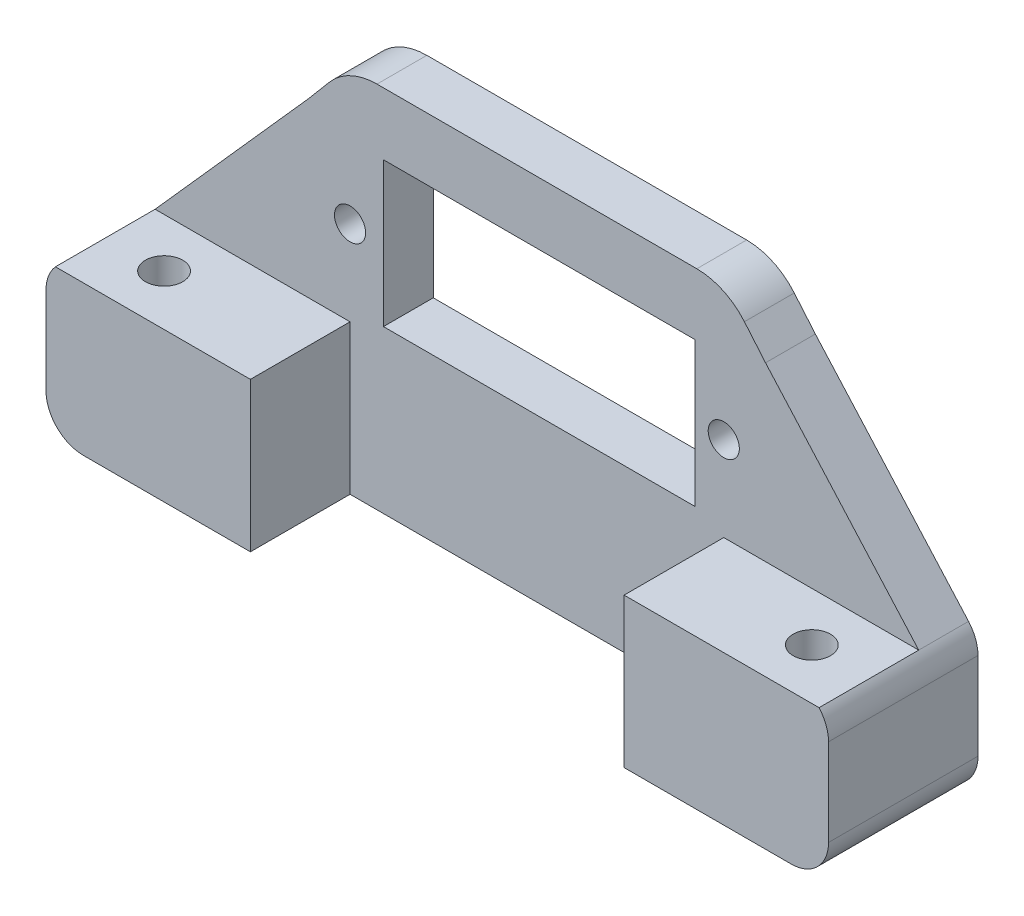
ISO-10303-21;
HEADER;
FILE_DESCRIPTION(('STEP AP214'),'2;1');
FILE_NAME('part.step','',(''),(''),'','','');
FILE_SCHEMA(('AUTOMOTIVE_DESIGN { 1 0 10303 214 1 1 1 1 }'));
ENDSEC;
DATA;
#1=APPLICATION_CONTEXT('core data for automotive mechanical design processes');
#2=APPLICATION_PROTOCOL_DEFINITION('international standard','automotive_design',2000,#1);
#3=PRODUCT_CONTEXT('',#1,'mechanical');
#4=PRODUCT('Part','Part','',(#3));
#5=PRODUCT_RELATED_PRODUCT_CATEGORY('part','',(#4));
#6=PRODUCT_DEFINITION_FORMATION('','',#4);
#7=PRODUCT_DEFINITION_CONTEXT('part definition',#1,'design');
#8=PRODUCT_DEFINITION('design','',#6,#7);
#9=PRODUCT_DEFINITION_SHAPE('','',#8);
#10=(LENGTH_UNIT() NAMED_UNIT(*) SI_UNIT(.MILLI.,.METRE.));
#11=(NAMED_UNIT(*) PLANE_ANGLE_UNIT() SI_UNIT($,.RADIAN.));
#12=(NAMED_UNIT(*) SI_UNIT($,.STERADIAN.) SOLID_ANGLE_UNIT());
#13=UNCERTAINTY_MEASURE_WITH_UNIT(LENGTH_MEASURE(1.E-05),#10,'distance_accuracy_value','');
#14=(GEOMETRIC_REPRESENTATION_CONTEXT(3) GLOBAL_UNCERTAINTY_ASSIGNED_CONTEXT((#13)) GLOBAL_UNIT_ASSIGNED_CONTEXT((#10,
#11,#12)) REPRESENTATION_CONTEXT('',''));
#15=CARTESIAN_POINT('',(0.,0.,0.));
#16=DIRECTION('',(0.,0.,1.));
#17=DIRECTION('',(1.,0.,0.));
#18=AXIS2_PLACEMENT_3D('',#15,#16,#17);
#19=CARTESIAN_POINT('',(41.4286280186862,-5.,4.));
#20=DIRECTION('',(0.,0.,-1.));
#21=DIRECTION('',(-1.,0.,0.));
#22=AXIS2_PLACEMENT_3D('',#19,#20,#21);
#23=CYLINDRICAL_SURFACE('',#22,5.);
#24=CARTESIAN_POINT('',(41.4286280186862,-5.,0.));
#25=DIRECTION('',(0.,0.,1.));
#26=DIRECTION('',(1.,0.,0.));
#27=AXIS2_PLACEMENT_3D('',#24,#25,#26);
#28=CIRCLE('',#27,5.);
#29=CARTESIAN_POINT('',(45.2485864933868,-1.77386961646575,0.));
#30=VERTEX_POINT('',#29);
#31=CARTESIAN_POINT('',(41.4286280186862,0.,0.));
#32=VERTEX_POINT('',#31);
#33=EDGE_CURVE('E221',#30,#32,#28,.T.);
#34=ORIENTED_EDGE('',*,*,#33,.T.);
#35=DIRECTION('',(0.,0.,-1.));
#36=VECTOR('',#35,1.);
#37=CARTESIAN_POINT('',(41.4286280186862,0.,4.));
#38=LINE('',#37,#36);
#39=CARTESIAN_POINT('',(41.4286280186862,0.,4.));
#40=VERTEX_POINT('',#39);
#41=EDGE_CURVE('E11',#40,#32,#38,.T.);
#42=ORIENTED_EDGE('',*,*,#41,.F.);
#43=CARTESIAN_POINT('',(41.4286280186862,-5.,4.));
#44=DIRECTION('',(0.,0.,1.));
#45=DIRECTION('',(1.,0.,0.));
#46=AXIS2_PLACEMENT_3D('',#43,#44,#45);
#47=CIRCLE('',#46,5.);
#48=CARTESIAN_POINT('',(45.2485864933868,-1.77386961646575,4.));
#49=VERTEX_POINT('',#48);
#50=EDGE_CURVE('E411',#49,#40,#47,.T.);
#51=ORIENTED_EDGE('',*,*,#50,.F.);
#52=DIRECTION('',(0.,0.,-1.));
#53=VECTOR('',#52,1.);
#54=CARTESIAN_POINT('',(45.2485864933868,-1.77386961646575,4.));
#55=LINE('',#54,#53);
#56=EDGE_CURVE('E255',#49,#30,#55,.T.);
#57=ORIENTED_EDGE('',*,*,#56,.T.);
#58=EDGE_LOOP('',(#34,#42,#51,#57));
#59=FACE_BOUND('',#58,.T.);
#60=ADVANCED_FACE('F41',(#59),#23,.T.);
#61=CARTESIAN_POINT('',(0.,0.,4.));
#62=DIRECTION('',(0.,1.,0.));
#63=DIRECTION('',(-1.,0.,0.));
#64=AXIS2_PLACEMENT_3D('',#61,#62,#63);
#65=PLANE('',#64);
#66=DIRECTION('',(1.,0.,0.));
#67=VECTOR('',#66,1.);
#68=CARTESIAN_POINT('',(0.,0.,0.));
#69=LINE('',#68,#67);
#70=CARTESIAN_POINT('',(15.7541159439414,0.,0.));
#71=VERTEX_POINT('',#70);
#72=EDGE_CURVE('E225',#71,#32,#69,.T.);
#73=ORIENTED_EDGE('',*,*,#72,.F.);
#74=DIRECTION('',(0.,0.,-1.));
#75=VECTOR('',#74,1.);
#76=CARTESIAN_POINT('',(15.7541159439414,0.,4.));
#77=LINE('',#76,#75);
#78=CARTESIAN_POINT('',(15.7541159439414,0.,4.));
#79=VERTEX_POINT('',#78);
#80=EDGE_CURVE('E52',#79,#71,#77,.T.);
#81=ORIENTED_EDGE('',*,*,#80,.F.);
#82=DIRECTION('',(1.,0.,0.));
#83=VECTOR('',#82,1.);
#84=CARTESIAN_POINT('',(0.,0.,4.));
#85=LINE('',#84,#83);
#86=EDGE_CURVE('E414',#79,#40,#85,.T.);
#87=ORIENTED_EDGE('',*,*,#86,.T.);
#88=ORIENTED_EDGE('',*,*,#41,.T.);
#89=EDGE_LOOP('',(#73,#81,#87,#88));
#90=FACE_BOUND('',#89,.T.);
#91=ADVANCED_FACE('F308',(#90),#65,.T.);
#92=CARTESIAN_POINT('',(15.7541159439414,-5.00000000000001,4.));
#93=DIRECTION('',(0.,0.,-1.));
#94=DIRECTION('',(-1.,0.,0.));
#95=AXIS2_PLACEMENT_3D('',#92,#93,#94);
#96=CYLINDRICAL_SURFACE('',#95,5.);
#97=CARTESIAN_POINT('',(15.7541159439414,-5.00000000000001,0.));
#98=DIRECTION('',(0.,0.,1.));
#99=DIRECTION('',(1.,0.,0.));
#100=AXIS2_PLACEMENT_3D('',#97,#98,#99);
#101=CIRCLE('',#100,5.);
#102=CARTESIAN_POINT('',(11.9341574692408,-1.77386961646574,0.));
#103=VERTEX_POINT('',#102);
#104=EDGE_CURVE('E229',#103,#71,#101,.F.);
#105=ORIENTED_EDGE('',*,*,#104,.F.);
#106=DIRECTION('',(0.,0.,-1.));
#107=VECTOR('',#106,1.);
#108=CARTESIAN_POINT('',(11.9341574692408,-1.77386961646574,4.));
#109=LINE('',#108,#107);
#110=CARTESIAN_POINT('',(11.9341574692408,-1.77386961646574,4.));
#111=VERTEX_POINT('',#110);
#112=EDGE_CURVE('E148',#111,#103,#109,.T.);
#113=ORIENTED_EDGE('',*,*,#112,.F.);
#114=CARTESIAN_POINT('',(15.7541159439414,-5.00000000000001,4.));
#115=DIRECTION('',(0.,0.,1.));
#116=DIRECTION('',(1.,0.,0.));
#117=AXIS2_PLACEMENT_3D('',#114,#115,#116);
#118=CIRCLE('',#117,5.);
#119=EDGE_CURVE('E160',#111,#79,#118,.F.);
#120=ORIENTED_EDGE('',*,*,#119,.T.);
#121=ORIENTED_EDGE('',*,*,#80,.T.);
#122=EDGE_LOOP('',(#105,#113,#120,#121));
#123=FACE_BOUND('',#122,.T.);
#124=ADVANCED_FACE('F314',(#123),#96,.T.);
#125=CARTESIAN_POINT('',(7.84019288441212,-6.62140299290913,4.));
#126=DIRECTION('',(-0.763991694940121,0.645226076706855,0.));
#127=DIRECTION('',(-0.645226076706855,-0.763991694940121,0.));
#128=AXIS2_PLACEMENT_3D('',#125,#126,#127);
#129=PLANE('',#128);
#130=DIRECTION('',(0.645226076706855,0.763991694940121,0.));
#131=VECTOR('',#130,1.);
#132=CARTESIAN_POINT('',(7.84019288441212,-6.62140299290913,0.));
#133=LINE('',#132,#131);
#134=CARTESIAN_POINT('',(10.2388227627629,-3.7812615720164,0.));
#135=VERTEX_POINT('',#134);
#136=EDGE_CURVE('E142',#135,#103,#133,.T.);
#137=ORIENTED_EDGE('',*,*,#136,.F.);
#138=DIRECTION('',(0.,0.,-1.));
#139=VECTOR('',#138,1.);
#140=CARTESIAN_POINT('',(10.2388227627629,-3.7812615720164,4.));
#141=LINE('',#140,#139);
#142=CARTESIAN_POINT('',(10.2388227627629,-3.7812615720164,4.));
#143=VERTEX_POINT('',#142);
#144=EDGE_CURVE('E137',#143,#135,#141,.T.);
#145=ORIENTED_EDGE('',*,*,#144,.F.);
#146=DIRECTION('',(0.645226076706855,0.763991694940121,0.));
#147=VECTOR('',#146,1.);
#148=CARTESIAN_POINT('',(7.84019288441212,-6.62140299290913,4.));
#149=LINE('',#148,#147);
#150=EDGE_CURVE('E140',#143,#111,#149,.T.);
#151=ORIENTED_EDGE('',*,*,#150,.T.);
#152=ORIENTED_EDGE('',*,*,#112,.T.);
#153=EDGE_LOOP('',(#137,#145,#151,#152));
#154=FACE_BOUND('',#153,.T.);
#155=ADVANCED_FACE('F139',(#154),#129,.T.);
#156=CARTESIAN_POINT('',(7.59390652992024,-6.75475778071939,4.));
#157=DIRECTION('',(-0.747183622636559,0.664617660060059,0.));
#158=DIRECTION('',(-0.664617660060059,-0.747183622636559,0.));
#159=AXIS2_PLACEMENT_3D('',#156,#157,#158);
#160=PLANE('',#159);
#161=DIRECTION('',(0.664617660060059,0.747183622636559,0.));
#162=VECTOR('',#161,1.);
#163=CARTESIAN_POINT('',(7.59390652992024,-6.75475778071939,0.));
#164=LINE('',#163,#162);
#165=CARTESIAN_POINT('',(-2.05913137357726,-17.607,0.));
#166=VERTEX_POINT('',#165);
#167=EDGE_CURVE('E235',#166,#135,#164,.T.);
#168=ORIENTED_EDGE('',*,*,#167,.F.);
#169=DIRECTION('',(0.,0.,-1.));
#170=VECTOR('',#169,1.);
#171=CARTESIAN_POINT('',(-2.05913137357726,-17.607,4.));
#172=LINE('',#171,#170);
#173=CARTESIAN_POINT('',(-2.05913137357726,-17.607,4.));
#174=VERTEX_POINT('',#173);
#175=EDGE_CURVE('E149',#174,#166,#172,.T.);
#176=ORIENTED_EDGE('',*,*,#175,.F.);
#177=DIRECTION('',(0.664617660060059,0.747183622636559,0.));
#178=VECTOR('',#177,1.);
#179=CARTESIAN_POINT('',(7.59390652992024,-6.75475778071939,4.));
#180=LINE('',#179,#178);
#181=EDGE_CURVE('E157',#174,#143,#180,.T.);
#182=ORIENTED_EDGE('',*,*,#181,.T.);
#183=ORIENTED_EDGE('',*,*,#144,.T.);
#184=EDGE_LOOP('',(#168,#176,#182,#183));
#185=FACE_BOUND('',#184,.T.);
#186=ADVANCED_FACE('F164',(#185),#160,.T.);
#187=CARTESIAN_POINT('',(0.,-29.6,4.));
#188=DIRECTION('',(0.,1.,0.));
#189=DIRECTION('',(0.,0.,1.));
#190=AXIS2_PLACEMENT_3D('',#187,#188,#189);
#191=PLANE('',#190);
#192=CARTESIAN_POINT('',(2.5913719813138,-29.6,7.92925546534134));
#193=DIRECTION('',(0.,1.,0.));
#194=DIRECTION('',(0.,0.,1.));
#195=AXIS2_PLACEMENT_3D('',#192,#193,#194);
#196=CIRCLE('',#195,1.5);
#197=CARTESIAN_POINT('',(2.5913719813138,-29.6,9.42925546534134));
#198=VERTEX_POINT('',#197);
#199=EDGE_CURVE('E686',#198,#198,#196,.T.);
#200=ORIENTED_EDGE('',*,*,#199,.T.);
#201=EDGE_LOOP('',(#200));
#202=FACE_BOUND('',#201,.T.);
#203=CARTESIAN_POINT('',(54.5913719813138,-29.6,7.92925546534134));
#204=DIRECTION('',(0.,1.,0.));
#205=DIRECTION('',(0.,0.,-1.));
#206=AXIS2_PLACEMENT_3D('',#203,#204,#205);
#207=CIRCLE('',#206,1.5);
#208=CARTESIAN_POINT('',(54.5913719813138,-29.6,6.42925546534133));
#209=VERTEX_POINT('',#208);
#210=EDGE_CURVE('E690',#209,#209,#207,.T.);
#211=ORIENTED_EDGE('',*,*,#210,.T.);
#212=EDGE_LOOP('',(#211));
#213=FACE_BOUND('',#212,.T.);
#214=DIRECTION('',(1.,0.,0.));
#215=VECTOR('',#214,1.);
#216=CARTESIAN_POINT('',(0.,-29.6,0.));
#217=LINE('',#216,#215);
#218=CARTESIAN_POINT('',(0.182743962627623,-29.6,0.));
#219=VERTEX_POINT('',#218);
#220=CARTESIAN_POINT('',(57.,-29.6,0.));
#221=VERTEX_POINT('',#220);
#222=EDGE_CURVE('E238',#219,#221,#217,.T.);
#223=ORIENTED_EDGE('',*,*,#222,.T.);
#224=DIRECTION('',(0.,0.,-1.));
#225=VECTOR('',#224,1.);
#226=CARTESIAN_POINT('',(57.,-29.6,12.));
#227=LINE('',#226,#225);
#228=CARTESIAN_POINT('',(57.,-29.6,12.));
#229=VERTEX_POINT('',#228);
#230=EDGE_CURVE('E358',#229,#221,#227,.T.);
#231=ORIENTED_EDGE('',*,*,#230,.F.);
#232=DIRECTION('',(1.,0.,0.));
#233=VECTOR('',#232,1.);
#234=CARTESIAN_POINT('',(0.,-29.6,12.));
#235=LINE('',#234,#233);
#236=CARTESIAN_POINT('',(43.5913719813138,-29.6,12.));
#237=VERTEX_POINT('',#236);
#238=EDGE_CURVE('E482',#237,#229,#235,.T.);
#239=ORIENTED_EDGE('',*,*,#238,.F.);
#240=DIRECTION('',(0.,0.,-1.));
#241=VECTOR('',#240,1.);
#242=CARTESIAN_POINT('',(43.5913719813138,-29.6,12.));
#243=LINE('',#242,#241);
#244=CARTESIAN_POINT('',(43.5913719813138,-29.6,4.));
#245=VERTEX_POINT('',#244);
#246=EDGE_CURVE('E479',#237,#245,#243,.T.);
#247=ORIENTED_EDGE('',*,*,#246,.T.);
#248=DIRECTION('',(1.,0.,0.));
#249=VECTOR('',#248,1.);
#250=CARTESIAN_POINT('',(0.,-29.6,4.));
#251=LINE('',#250,#249);
#252=CARTESIAN_POINT('',(13.5913719813138,-29.6,4.));
#253=VERTEX_POINT('',#252);
#254=EDGE_CURVE('E178',#253,#245,#251,.T.);
#255=ORIENTED_EDGE('',*,*,#254,.F.);
#256=DIRECTION('',(0.,0.,-1.));
#257=VECTOR('',#256,1.);
#258=CARTESIAN_POINT('',(13.5913719813138,-29.6,12.));
#259=LINE('',#258,#257);
#260=CARTESIAN_POINT('',(13.5913719813138,-29.6,12.));
#261=VERTEX_POINT('',#260);
#262=EDGE_CURVE('E380',#261,#253,#259,.T.);
#263=ORIENTED_EDGE('',*,*,#262,.F.);
#264=DIRECTION('',(1.,0.,0.));
#265=VECTOR('',#264,1.);
#266=CARTESIAN_POINT('',(0.,-29.6,12.));
#267=LINE('',#266,#265);
#268=CARTESIAN_POINT('',(0.182743962627623,-29.6,12.));
#269=VERTEX_POINT('',#268);
#270=EDGE_CURVE('E522',#269,#261,#267,.T.);
#271=ORIENTED_EDGE('',*,*,#270,.F.);
#272=DIRECTION('',(0.,0.,-1.));
#273=VECTOR('',#272,1.);
#274=CARTESIAN_POINT('',(0.182743962627623,-29.6,12.));
#275=LINE('',#274,#273);
#276=EDGE_CURVE('E391',#269,#219,#275,.T.);
#277=ORIENTED_EDGE('',*,*,#276,.T.);
#278=EDGE_LOOP('',(#223,#231,#239,#247,#255,#263,#271,#277));
#279=FACE_BOUND('',#278,.T.);
#280=ADVANCED_FACE('F333',(#202,#213,#279),#191,.F.);
#281=CARTESIAN_POINT('',(24.3302682430086,21.6417028671511,4.));
#282=DIRECTION('',(-0.747183622636559,-0.66461766006006,0.));
#283=DIRECTION('',(0.66461766006006,-0.747183622636559,0.));
#284=AXIS2_PLACEMENT_3D('',#281,#282,#283);
#285=PLANE('',#284);
#286=DIRECTION('',(-0.66461766006006,0.747183622636559,0.));
#287=VECTOR('',#286,1.);
#288=CARTESIAN_POINT('',(24.3302682430086,21.6417028671511,0.));
#289=LINE('',#288,#287);
#290=CARTESIAN_POINT('',(59.2418753362049,-17.607,0.));
#291=VERTEX_POINT('',#290);
#292=CARTESIAN_POINT('',(46.9439211998647,-3.78126157201639,0.));
#293=VERTEX_POINT('',#292);
#294=EDGE_CURVE('E99',#291,#293,#289,.T.);
#295=ORIENTED_EDGE('',*,*,#294,.T.);
#296=DIRECTION('',(0.,0.,-1.));
#297=VECTOR('',#296,1.);
#298=CARTESIAN_POINT('',(46.9439211998647,-3.78126157201639,4.));
#299=LINE('',#298,#297);
#300=CARTESIAN_POINT('',(46.9439211998647,-3.78126157201639,4.));
#301=VERTEX_POINT('',#300);
#302=EDGE_CURVE('E258',#301,#293,#299,.T.);
#303=ORIENTED_EDGE('',*,*,#302,.F.);
#304=DIRECTION('',(-0.66461766006006,0.747183622636559,0.));
#305=VECTOR('',#304,1.);
#306=CARTESIAN_POINT('',(24.3302682430086,21.6417028671511,4.));
#307=LINE('',#306,#305);
#308=CARTESIAN_POINT('',(59.2418753362049,-17.607,4.));
#309=VERTEX_POINT('',#308);
#310=EDGE_CURVE('E190',#309,#301,#307,.T.);
#311=ORIENTED_EDGE('',*,*,#310,.F.);
#312=DIRECTION('',(0.,0.,-1.));
#313=VECTOR('',#312,1.);
#314=CARTESIAN_POINT('',(59.2418753362049,-17.607,4.));
#315=LINE('',#314,#313);
#316=EDGE_CURVE('E261',#309,#291,#315,.T.);
#317=ORIENTED_EDGE('',*,*,#316,.T.);
#318=EDGE_LOOP('',(#295,#303,#311,#317));
#319=FACE_BOUND('',#318,.T.);
#320=ADVANCED_FACE('F330',(#319),#285,.F.);
#321=CARTESIAN_POINT('',(0.,-5.,4.));
#322=DIRECTION('',(0.,1.,0.));
#323=DIRECTION('',(-1.,0.,0.));
#324=AXIS2_PLACEMENT_3D('',#321,#322,#323);
#325=PLANE('',#324);
#326=DIRECTION('',(1.,0.,0.));
#327=VECTOR('',#326,1.);
#328=CARTESIAN_POINT('',(0.,-5.,0.));
#329=LINE('',#328,#327);
#330=CARTESIAN_POINT('',(16.2713719813138,-5.,0.));
#331=VERTEX_POINT('',#330);
#332=CARTESIAN_POINT('',(41.2713719813138,-5.,0.));
#333=VERTEX_POINT('',#332);
#334=EDGE_CURVE('E204',#331,#333,#329,.T.);
#335=ORIENTED_EDGE('',*,*,#334,.T.);
#336=DIRECTION('',(0.,0.,-1.));
#337=VECTOR('',#336,1.);
#338=CARTESIAN_POINT('',(41.2713719813138,-5.,4.));
#339=LINE('',#338,#337);
#340=CARTESIAN_POINT('',(41.2713719813138,-5.,4.));
#341=VERTEX_POINT('',#340);
#342=EDGE_CURVE('E45',#341,#333,#339,.T.);
#343=ORIENTED_EDGE('',*,*,#342,.F.);
#344=DIRECTION('',(1.,0.,0.));
#345=VECTOR('',#344,1.);
#346=CARTESIAN_POINT('',(0.,-5.,4.));
#347=LINE('',#346,#345);
#348=CARTESIAN_POINT('',(16.2713719813138,-5.,4.));
#349=VERTEX_POINT('',#348);
#350=EDGE_CURVE('E254',#349,#341,#347,.T.);
#351=ORIENTED_EDGE('',*,*,#350,.F.);
#352=DIRECTION('',(0.,0.,-1.));
#353=VECTOR('',#352,1.);
#354=CARTESIAN_POINT('',(16.2713719813138,-5.,4.));
#355=LINE('',#354,#353);
#356=EDGE_CURVE('E203',#349,#331,#355,.T.);
#357=ORIENTED_EDGE('',*,*,#356,.T.);
#358=EDGE_LOOP('',(#335,#343,#351,#357));
#359=FACE_BOUND('',#358,.T.);
#360=ADVANCED_FACE('F43',(#359),#325,.F.);
#361=CARTESIAN_POINT('',(41.2713719813138,0.,4.));
#362=DIRECTION('',(1.,0.,0.));
#363=DIRECTION('',(0.,0.,-1.));
#364=AXIS2_PLACEMENT_3D('',#361,#362,#363);
#365=PLANE('',#364);
#366=DIRECTION('',(0.,-1.,0.));
#367=VECTOR('',#366,1.);
#368=CARTESIAN_POINT('',(41.2713719813138,0.,0.));
#369=LINE('',#368,#367);
#370=CARTESIAN_POINT('',(41.2713719813138,-16.6,0.));
#371=VERTEX_POINT('',#370);
#372=EDGE_CURVE('E208',#333,#371,#369,.T.);
#373=ORIENTED_EDGE('',*,*,#372,.T.);
#374=DIRECTION('',(0.,0.,-1.));
#375=VECTOR('',#374,1.);
#376=CARTESIAN_POINT('',(41.2713719813138,-16.6,4.));
#377=LINE('',#376,#375);
#378=CARTESIAN_POINT('',(41.2713719813138,-16.6,4.));
#379=VERTEX_POINT('',#378);
#380=EDGE_CURVE('E274',#379,#371,#377,.T.);
#381=ORIENTED_EDGE('',*,*,#380,.F.);
#382=DIRECTION('',(0.,-1.,0.));
#383=VECTOR('',#382,1.);
#384=CARTESIAN_POINT('',(41.2713719813138,0.,4.));
#385=LINE('',#384,#383);
#386=EDGE_CURVE('E114',#341,#379,#385,.T.);
#387=ORIENTED_EDGE('',*,*,#386,.F.);
#388=ORIENTED_EDGE('',*,*,#342,.T.);
#389=EDGE_LOOP('',(#373,#381,#387,#388));
#390=FACE_BOUND('',#389,.T.);
#391=ADVANCED_FACE('F281',(#390),#365,.F.);
#392=CARTESIAN_POINT('',(0.,-16.6,4.));
#393=DIRECTION('',(0.,1.,0.));
#394=DIRECTION('',(0.,0.,1.));
#395=AXIS2_PLACEMENT_3D('',#392,#393,#394);
#396=PLANE('',#395);
#397=DIRECTION('',(1.,0.,0.));
#398=VECTOR('',#397,1.);
#399=CARTESIAN_POINT('',(0.,-16.6,0.));
#400=LINE('',#399,#398);
#401=CARTESIAN_POINT('',(16.2713719813138,-16.6,0.));
#402=VERTEX_POINT('',#401);
#403=EDGE_CURVE('E213',#402,#371,#400,.T.);
#404=ORIENTED_EDGE('',*,*,#403,.F.);
#405=DIRECTION('',(0.,0.,-1.));
#406=VECTOR('',#405,1.);
#407=CARTESIAN_POINT('',(16.2713719813138,-16.6,4.));
#408=LINE('',#407,#406);
#409=CARTESIAN_POINT('',(16.2713719813138,-16.6,4.));
#410=VERTEX_POINT('',#409);
#411=EDGE_CURVE('E272',#410,#402,#408,.T.);
#412=ORIENTED_EDGE('',*,*,#411,.F.);
#413=DIRECTION('',(1.,0.,0.));
#414=VECTOR('',#413,1.);
#415=CARTESIAN_POINT('',(0.,-16.6,4.));
#416=LINE('',#415,#414);
#417=EDGE_CURVE('E406',#410,#379,#416,.T.);
#418=ORIENTED_EDGE('',*,*,#417,.T.);
#419=ORIENTED_EDGE('',*,*,#380,.T.);
#420=EDGE_LOOP('',(#404,#412,#418,#419));
#421=FACE_BOUND('',#420,.T.);
#422=ADVANCED_FACE('F295',(#421),#396,.T.);
#423=CARTESIAN_POINT('',(13.5913719813138,-10.8,4.));
#424=DIRECTION('',(0.,0.,-1.));
#425=DIRECTION('',(-1.,0.,0.));
#426=AXIS2_PLACEMENT_3D('',#423,#424,#425);
#427=CYLINDRICAL_SURFACE('',#426,1.25);
#428=CARTESIAN_POINT('',(13.5913719813138,-10.8,4.));
#429=DIRECTION('',(0.,0.,1.));
#430=DIRECTION('',(1.,0.,0.));
#431=AXIS2_PLACEMENT_3D('',#428,#429,#430);
#432=CIRCLE('',#431,1.25);
#433=CARTESIAN_POINT('',(14.8413719813138,-10.8,4.));
#434=VERTEX_POINT('',#433);
#435=EDGE_CURVE('E195',#434,#434,#432,.F.);
#436=ORIENTED_EDGE('',*,*,#435,.F.);
#437=EDGE_LOOP('',(#436));
#438=FACE_BOUND('',#437,.T.);
#439=CARTESIAN_POINT('',(13.5913719813138,-10.8,0.));
#440=DIRECTION('',(0.,0.,1.));
#441=DIRECTION('',(1.,0.,0.));
#442=AXIS2_PLACEMENT_3D('',#439,#440,#441);
#443=CIRCLE('',#442,1.25);
#444=CARTESIAN_POINT('',(14.8413719813138,-10.8,0.));
#445=VERTEX_POINT('',#444);
#446=EDGE_CURVE('E246',#445,#445,#443,.F.);
#447=ORIENTED_EDGE('',*,*,#446,.T.);
#448=EDGE_LOOP('',(#447));
#449=FACE_BOUND('',#448,.T.);
#450=ADVANCED_FACE('F297',(#438,#449),#427,.F.);
#451=CARTESIAN_POINT('',(25.5364203830019,21.5666799076299,4.));
#452=DIRECTION('',(-0.763991694940123,-0.645226076706853,0.));
#453=DIRECTION('',(0.645226076706853,-0.763991694940123,0.));
#454=AXIS2_PLACEMENT_3D('',#451,#452,#453);
#455=PLANE('',#454);
#456=DIRECTION('',(-0.645226076706853,0.763991694940123,0.));
#457=VECTOR('',#456,1.);
#458=CARTESIAN_POINT('',(25.5364203830019,21.5666799076299,0.));
#459=LINE('',#458,#457);
#460=EDGE_CURVE('E105',#293,#30,#459,.T.);
#461=ORIENTED_EDGE('',*,*,#460,.T.);
#462=ORIENTED_EDGE('',*,*,#56,.F.);
#463=DIRECTION('',(-0.645226076706853,0.763991694940123,0.));
#464=VECTOR('',#463,1.);
#465=CARTESIAN_POINT('',(25.5364203830019,21.5666799076299,4.));
#466=LINE('',#465,#464);
#467=EDGE_CURVE('E61',#301,#49,#466,.T.);
#468=ORIENTED_EDGE('',*,*,#467,.F.);
#469=ORIENTED_EDGE('',*,*,#302,.T.);
#470=EDGE_LOOP('',(#461,#462,#468,#469));
#471=FACE_BOUND('',#470,.T.);
#472=ADVANCED_FACE('F303',(#471),#455,.F.);
#473=CARTESIAN_POINT('',(16.2713719813138,0.,4.));
#474=DIRECTION('',(1.,0.,0.));
#475=DIRECTION('',(0.,0.,-1.));
#476=AXIS2_PLACEMENT_3D('',#473,#474,#475);
#477=PLANE('',#476);
#478=DIRECTION('',(0.,-1.,0.));
#479=VECTOR('',#478,1.);
#480=CARTESIAN_POINT('',(16.2713719813138,0.,0.));
#481=LINE('',#480,#479);
#482=EDGE_CURVE('E217',#331,#402,#481,.T.);
#483=ORIENTED_EDGE('',*,*,#482,.F.);
#484=ORIENTED_EDGE('',*,*,#356,.F.);
#485=DIRECTION('',(0.,-1.,0.));
#486=VECTOR('',#485,1.);
#487=CARTESIAN_POINT('',(16.2713719813138,0.,4.));
#488=LINE('',#487,#486);
#489=EDGE_CURVE('E293',#349,#410,#488,.T.);
#490=ORIENTED_EDGE('',*,*,#489,.T.);
#491=ORIENTED_EDGE('',*,*,#411,.T.);
#492=EDGE_LOOP('',(#483,#484,#490,#491));
#493=FACE_BOUND('',#492,.T.);
#494=ADVANCED_FACE('F290',(#493),#477,.T.);
#495=CARTESIAN_POINT('',(43.5913719813138,-10.8,4.));
#496=DIRECTION('',(0.,0.,-1.));
#497=DIRECTION('',(-1.,0.,0.));
#498=AXIS2_PLACEMENT_3D('',#495,#496,#497);
#499=CYLINDRICAL_SURFACE('',#498,1.25);
#500=CARTESIAN_POINT('',(43.5913719813138,-10.8,4.));
#501=DIRECTION('',(0.,0.,1.));
#502=DIRECTION('',(1.,0.,0.));
#503=AXIS2_PLACEMENT_3D('',#500,#501,#502);
#504=CIRCLE('',#503,1.25);
#505=CARTESIAN_POINT('',(44.8413719813138,-10.8,4.));
#506=VERTEX_POINT('',#505);
#507=EDGE_CURVE('E199',#506,#506,#504,.T.);
#508=ORIENTED_EDGE('',*,*,#507,.T.);
#509=EDGE_LOOP('',(#508));
#510=FACE_BOUND('',#509,.T.);
#511=CARTESIAN_POINT('',(43.5913719813138,-10.8,0.));
#512=DIRECTION('',(0.,0.,1.));
#513=DIRECTION('',(1.,0.,0.));
#514=AXIS2_PLACEMENT_3D('',#511,#512,#513);
#515=CIRCLE('',#514,1.25);
#516=CARTESIAN_POINT('',(44.8413719813138,-10.8,0.));
#517=VERTEX_POINT('',#516);
#518=EDGE_CURVE('E250',#517,#517,#515,.T.);
#519=ORIENTED_EDGE('',*,*,#518,.F.);
#520=EDGE_LOOP('',(#519));
#521=FACE_BOUND('',#520,.T.);
#522=ADVANCED_FACE('F319',(#510,#521),#499,.F.);
#523=CARTESIAN_POINT('',(0.,0.,4.));
#524=DIRECTION('',(0.,0.,1.));
#525=DIRECTION('',(1.,0.,0.));
#526=AXIS2_PLACEMENT_3D('',#523,#524,#525);
#527=PLANE('',#526);
#528=ORIENTED_EDGE('',*,*,#350,.T.);
#529=ORIENTED_EDGE('',*,*,#386,.T.);
#530=ORIENTED_EDGE('',*,*,#417,.F.);
#531=ORIENTED_EDGE('',*,*,#489,.F.);
#532=EDGE_LOOP('',(#528,#529,#530,#531));
#533=FACE_BOUND('',#532,.T.);
#534=ORIENTED_EDGE('',*,*,#50,.T.);
#535=ORIENTED_EDGE('',*,*,#86,.F.);
#536=ORIENTED_EDGE('',*,*,#119,.F.);
#537=ORIENTED_EDGE('',*,*,#150,.F.);
#538=ORIENTED_EDGE('',*,*,#181,.F.);
#539=DIRECTION('',(-1.,0.,0.));
#540=VECTOR('',#539,1.);
#541=CARTESIAN_POINT('',(0.,-17.607,4.));
#542=LINE('',#541,#540);
#543=CARTESIAN_POINT('',(13.5913719813138,-17.607,4.));
#544=VERTEX_POINT('',#543);
#545=EDGE_CURVE('E167',#544,#174,#542,.T.);
#546=ORIENTED_EDGE('',*,*,#545,.F.);
#547=DIRECTION('',(0.,-1.,0.));
#548=VECTOR('',#547,1.);
#549=CARTESIAN_POINT('',(13.5913719813138,0.,4.));
#550=LINE('',#549,#548);
#551=EDGE_CURVE('E171',#544,#253,#550,.T.);
#552=ORIENTED_EDGE('',*,*,#551,.T.);
#553=ORIENTED_EDGE('',*,*,#254,.T.);
#554=DIRECTION('',(0.,-1.,0.));
#555=VECTOR('',#554,1.);
#556=CARTESIAN_POINT('',(43.5913719813138,0.,4.));
#557=LINE('',#556,#555);
#558=CARTESIAN_POINT('',(43.5913719813138,-17.607,4.));
#559=VERTEX_POINT('',#558);
#560=EDGE_CURVE('E182',#559,#245,#557,.T.);
#561=ORIENTED_EDGE('',*,*,#560,.F.);
#562=DIRECTION('',(-1.,0.,0.));
#563=VECTOR('',#562,1.);
#564=CARTESIAN_POINT('',(0.,-17.607,4.));
#565=LINE('',#564,#563);
#566=EDGE_CURVE('E186',#309,#559,#565,.T.);
#567=ORIENTED_EDGE('',*,*,#566,.F.);
#568=ORIENTED_EDGE('',*,*,#310,.T.);
#569=ORIENTED_EDGE('',*,*,#467,.T.);
#570=EDGE_LOOP('',(#534,#535,#536,#537,#538,#546,#552,#553,#561,#567,#568,#569));
#571=FACE_BOUND('',#570,.T.);
#572=ORIENTED_EDGE('',*,*,#435,.T.);
#573=EDGE_LOOP('',(#572));
#574=FACE_BOUND('',#573,.T.);
#575=ORIENTED_EDGE('',*,*,#507,.F.);
#576=EDGE_LOOP('',(#575));
#577=FACE_BOUND('',#576,.T.);
#578=ADVANCED_FACE('F153',(#533,#571,#574,#577),#527,.T.);
#579=CARTESIAN_POINT('',(0.,0.,0.));
#580=DIRECTION('',(0.,0.,1.));
#581=DIRECTION('',(1.,0.,0.));
#582=AXIS2_PLACEMENT_3D('',#579,#580,#581);
#583=PLANE('',#582);
#584=ORIENTED_EDGE('',*,*,#222,.F.);
#585=CARTESIAN_POINT('',(0.182743962627623,-26.6,0.));
#586=DIRECTION('',(0.,0.,1.));
#587=DIRECTION('',(1.,0.,0.));
#588=AXIS2_PLACEMENT_3D('',#585,#586,#587);
#589=CIRCLE('',#588,2.99999999999999);
#590=CARTESIAN_POINT('',(-2.81725603737237,-26.6,0.));
#591=VERTEX_POINT('',#590);
#592=EDGE_CURVE('E385',#219,#591,#589,.F.);
#593=ORIENTED_EDGE('',*,*,#592,.T.);
#594=DIRECTION('',(0.,-1.,0.));
#595=VECTOR('',#594,1.);
#596=CARTESIAN_POINT('',(-2.81725603737243,0.,0.));
#597=LINE('',#596,#595);
#598=CARTESIAN_POINT('',(-2.81725603737239,-19.6,0.));
#599=VERTEX_POINT('',#598);
#600=EDGE_CURVE('E354',#599,#591,#597,.T.);
#601=ORIENTED_EDGE('',*,*,#600,.F.);
#602=CARTESIAN_POINT('',(0.181460547769061,-19.6,0.));
#603=DIRECTION('',(0.,0.,1.));
#604=DIRECTION('',(1.,0.,0.));
#605=AXIS2_PLACEMENT_3D('',#602,#603,#604);
#606=CIRCLE('',#605,2.99871658514145);
#607=EDGE_CURVE('E350',#599,#166,#606,.F.);
#608=ORIENTED_EDGE('',*,*,#607,.T.);
#609=ORIENTED_EDGE('',*,*,#167,.T.);
#610=ORIENTED_EDGE('',*,*,#136,.T.);
#611=ORIENTED_EDGE('',*,*,#104,.T.);
#612=ORIENTED_EDGE('',*,*,#72,.T.);
#613=ORIENTED_EDGE('',*,*,#33,.F.);
#614=ORIENTED_EDGE('',*,*,#460,.F.);
#615=ORIENTED_EDGE('',*,*,#294,.F.);
#616=CARTESIAN_POINT('',(57.0012834148586,-19.6,0.));
#617=DIRECTION('',(0.,0.,1.));
#618=DIRECTION('',(1.,0.,0.));
#619=AXIS2_PLACEMENT_3D('',#616,#617,#618);
#620=CIRCLE('',#619,2.99871658514144);
#621=CARTESIAN_POINT('',(60.,-19.6,0.));
#622=VERTEX_POINT('',#621);
#623=EDGE_CURVE('E426',#622,#291,#620,.T.);
#624=ORIENTED_EDGE('',*,*,#623,.F.);
#625=DIRECTION('',(0.,-1.,0.));
#626=VECTOR('',#625,1.);
#627=CARTESIAN_POINT('',(60.,0.,0.));
#628=LINE('',#627,#626);
#629=CARTESIAN_POINT('',(60.,-26.6,0.));
#630=VERTEX_POINT('',#629);
#631=EDGE_CURVE('E722',#622,#630,#628,.T.);
#632=ORIENTED_EDGE('',*,*,#631,.T.);
#633=CARTESIAN_POINT('',(57.,-26.6,0.));
#634=DIRECTION('',(0.,0.,1.));
#635=DIRECTION('',(1.,0.,0.));
#636=AXIS2_PLACEMENT_3D('',#633,#634,#635);
#637=CIRCLE('',#636,3.);
#638=EDGE_CURVE('E694',#221,#630,#637,.T.);
#639=ORIENTED_EDGE('',*,*,#638,.F.);
#640=EDGE_LOOP('',(#584,#593,#601,#608,#609,#610,#611,#612,#613,#614,#615,#624,#632,#639));
#641=FACE_BOUND('',#640,.T.);
#642=ORIENTED_EDGE('',*,*,#334,.F.);
#643=ORIENTED_EDGE('',*,*,#482,.T.);
#644=ORIENTED_EDGE('',*,*,#403,.T.);
#645=ORIENTED_EDGE('',*,*,#372,.F.);
#646=EDGE_LOOP('',(#642,#643,#644,#645));
#647=FACE_BOUND('',#646,.T.);
#648=ORIENTED_EDGE('',*,*,#446,.F.);
#649=EDGE_LOOP('',(#648));
#650=FACE_BOUND('',#649,.T.);
#651=ORIENTED_EDGE('',*,*,#518,.T.);
#652=EDGE_LOOP('',(#651));
#653=FACE_BOUND('',#652,.T.);
#654=ADVANCED_FACE('F287',(#641,#647,#650,#653),#583,.F.);
#655=CARTESIAN_POINT('',(0.181460547769061,-19.6,12.));
#656=DIRECTION('',(0.,0.,-1.));
#657=DIRECTION('',(-1.,0.,0.));
#658=AXIS2_PLACEMENT_3D('',#655,#656,#657);
#659=CYLINDRICAL_SURFACE('',#658,2.99871658514145);
#660=ORIENTED_EDGE('',*,*,#607,.F.);
#661=DIRECTION('',(0.,0.,-1.));
#662=VECTOR('',#661,1.);
#663=CARTESIAN_POINT('',(-2.81725603737239,-19.6,12.));
#664=LINE('',#663,#662);
#665=CARTESIAN_POINT('',(-2.81725603737239,-19.6,12.));
#666=VERTEX_POINT('',#665);
#667=EDGE_CURVE('E209',#666,#599,#664,.T.);
#668=ORIENTED_EDGE('',*,*,#667,.F.);
#669=CARTESIAN_POINT('',(0.181460547769061,-19.6,12.));
#670=DIRECTION('',(0.,0.,1.));
#671=DIRECTION('',(1.,0.,0.));
#672=AXIS2_PLACEMENT_3D('',#669,#670,#671);
#673=CIRCLE('',#672,2.99871658514145);
#674=CARTESIAN_POINT('',(-2.05913137357726,-17.607,12.));
#675=VERTEX_POINT('',#674);
#676=EDGE_CURVE('E367',#666,#675,#673,.F.);
#677=ORIENTED_EDGE('',*,*,#676,.T.);
#678=DIRECTION('',(0.,0.,-1.));
#679=VECTOR('',#678,1.);
#680=CARTESIAN_POINT('',(-2.05913137357726,-17.607,12.));
#681=LINE('',#680,#679);
#682=EDGE_CURVE('E364',#675,#174,#681,.T.);
#683=ORIENTED_EDGE('',*,*,#682,.T.);
#684=ORIENTED_EDGE('',*,*,#175,.T.);
#685=EDGE_LOOP('',(#660,#668,#677,#683,#684));
#686=FACE_BOUND('',#685,.T.);
#687=ADVANCED_FACE('F361',(#686),#659,.T.);
#688=CARTESIAN_POINT('',(-2.81725603737243,0.,12.));
#689=DIRECTION('',(1.,0.,0.));
#690=DIRECTION('',(0.,1.,0.));
#691=AXIS2_PLACEMENT_3D('',#688,#689,#690);
#692=PLANE('',#691);
#693=ORIENTED_EDGE('',*,*,#600,.T.);
#694=DIRECTION('',(0.,0.,-1.));
#695=VECTOR('',#694,1.);
#696=CARTESIAN_POINT('',(-2.81725603737237,-26.6,12.));
#697=LINE('',#696,#695);
#698=CARTESIAN_POINT('',(-2.81725603737237,-26.6,12.));
#699=VERTEX_POINT('',#698);
#700=EDGE_CURVE('E395',#699,#591,#697,.T.);
#701=ORIENTED_EDGE('',*,*,#700,.F.);
#702=DIRECTION('',(0.,-1.,0.));
#703=VECTOR('',#702,1.);
#704=CARTESIAN_POINT('',(-2.81725603737243,0.,12.));
#705=LINE('',#704,#703);
#706=EDGE_CURVE('E515',#666,#699,#705,.T.);
#707=ORIENTED_EDGE('',*,*,#706,.F.);
#708=ORIENTED_EDGE('',*,*,#667,.T.);
#709=EDGE_LOOP('',(#693,#701,#707,#708));
#710=FACE_BOUND('',#709,.T.);
#711=ADVANCED_FACE('F536',(#710),#692,.F.);
#712=CARTESIAN_POINT('',(0.182743962627623,-26.6,12.));
#713=DIRECTION('',(0.,0.,-1.));
#714=DIRECTION('',(-1.,0.,0.));
#715=AXIS2_PLACEMENT_3D('',#712,#713,#714);
#716=CYLINDRICAL_SURFACE('',#715,2.99999999999999);
#717=ORIENTED_EDGE('',*,*,#592,.F.);
#718=ORIENTED_EDGE('',*,*,#276,.F.);
#719=CARTESIAN_POINT('',(0.182743962627623,-26.6,12.));
#720=DIRECTION('',(0.,0.,1.));
#721=DIRECTION('',(1.,0.,0.));
#722=AXIS2_PLACEMENT_3D('',#719,#720,#721);
#723=CIRCLE('',#722,2.99999999999999);
#724=EDGE_CURVE('E518',#269,#699,#723,.F.);
#725=ORIENTED_EDGE('',*,*,#724,.T.);
#726=ORIENTED_EDGE('',*,*,#700,.T.);
#727=EDGE_LOOP('',(#717,#718,#725,#726));
#728=FACE_BOUND('',#727,.T.);
#729=ADVANCED_FACE('F533',(#728),#716,.T.);
#730=CARTESIAN_POINT('',(13.5913719813138,0.,12.));
#731=DIRECTION('',(1.,0.,0.));
#732=DIRECTION('',(0.,0.,-1.));
#733=AXIS2_PLACEMENT_3D('',#730,#731,#732);
#734=PLANE('',#733);
#735=ORIENTED_EDGE('',*,*,#262,.T.);
#736=ORIENTED_EDGE('',*,*,#551,.F.);
#737=DIRECTION('',(0.,0.,-1.));
#738=VECTOR('',#737,1.);
#739=CARTESIAN_POINT('',(13.5913719813138,-17.607,12.));
#740=LINE('',#739,#738);
#741=CARTESIAN_POINT('',(13.5913719813138,-17.607,12.));
#742=VERTEX_POINT('',#741);
#743=EDGE_CURVE('E374',#742,#544,#740,.T.);
#744=ORIENTED_EDGE('',*,*,#743,.F.);
#745=DIRECTION('',(0.,-1.,0.));
#746=VECTOR('',#745,1.);
#747=CARTESIAN_POINT('',(13.5913719813138,0.,12.));
#748=LINE('',#747,#746);
#749=EDGE_CURVE('E382',#742,#261,#748,.T.);
#750=ORIENTED_EDGE('',*,*,#749,.T.);
#751=EDGE_LOOP('',(#735,#736,#744,#750));
#752=FACE_BOUND('',#751,.T.);
#753=ADVANCED_FACE('F470',(#752),#734,.T.);
#754=CARTESIAN_POINT('',(0.,-17.607,12.));
#755=DIRECTION('',(0.,1.,0.));
#756=DIRECTION('',(0.,0.,1.));
#757=AXIS2_PLACEMENT_3D('',#754,#755,#756);
#758=PLANE('',#757);
#759=CARTESIAN_POINT('',(2.5913719813138,-17.607,7.92925546534134));
#760=DIRECTION('',(0.,1.,0.));
#761=DIRECTION('',(0.,0.,1.));
#762=AXIS2_PLACEMENT_3D('',#759,#760,#761);
#763=CIRCLE('',#762,1.5);
#764=CARTESIAN_POINT('',(2.5913719813138,-17.607,9.42925546534134));
#765=VERTEX_POINT('',#764);
#766=EDGE_CURVE('E688',#765,#765,#763,.T.);
#767=ORIENTED_EDGE('',*,*,#766,.F.);
#768=EDGE_LOOP('',(#767));
#769=FACE_BOUND('',#768,.T.);
#770=ORIENTED_EDGE('',*,*,#743,.T.);
#771=ORIENTED_EDGE('',*,*,#545,.T.);
#772=ORIENTED_EDGE('',*,*,#682,.F.);
#773=DIRECTION('',(1.,0.,0.));
#774=VECTOR('',#773,1.);
#775=CARTESIAN_POINT('',(0.,-17.607,12.));
#776=LINE('',#775,#774);
#777=EDGE_CURVE('E375',#675,#742,#776,.T.);
#778=ORIENTED_EDGE('',*,*,#777,.T.);
#779=EDGE_LOOP('',(#770,#771,#772,#778));
#780=FACE_BOUND('',#779,.T.);
#781=ADVANCED_FACE('F539',(#769,#780),#758,.T.);
#782=CARTESIAN_POINT('',(0.,0.,12.));
#783=DIRECTION('',(0.,0.,1.));
#784=DIRECTION('',(1.,0.,0.));
#785=AXIS2_PLACEMENT_3D('',#782,#783,#784);
#786=PLANE('',#785);
#787=ORIENTED_EDGE('',*,*,#676,.F.);
#788=ORIENTED_EDGE('',*,*,#706,.T.);
#789=ORIENTED_EDGE('',*,*,#724,.F.);
#790=ORIENTED_EDGE('',*,*,#270,.T.);
#791=ORIENTED_EDGE('',*,*,#749,.F.);
#792=ORIENTED_EDGE('',*,*,#777,.F.);
#793=EDGE_LOOP('',(#787,#788,#789,#790,#791,#792));
#794=FACE_BOUND('',#793,.T.);
#795=ADVANCED_FACE('F538',(#794),#786,.T.);
#796=CARTESIAN_POINT('',(57.,-26.6,12.));
#797=DIRECTION('',(0.,0.,-1.));
#798=DIRECTION('',(-1.,0.,0.));
#799=AXIS2_PLACEMENT_3D('',#796,#797,#798);
#800=CYLINDRICAL_SURFACE('',#799,3.);
#801=ORIENTED_EDGE('',*,*,#638,.T.);
#802=DIRECTION('',(0.,0.,-1.));
#803=VECTOR('',#802,1.);
#804=CARTESIAN_POINT('',(60.,-26.6,12.));
#805=LINE('',#804,#803);
#806=CARTESIAN_POINT('',(60.,-26.6,12.));
#807=VERTEX_POINT('',#806);
#808=EDGE_CURVE('E506',#807,#630,#805,.T.);
#809=ORIENTED_EDGE('',*,*,#808,.F.);
#810=CARTESIAN_POINT('',(57.,-26.6,12.));
#811=DIRECTION('',(0.,0.,1.));
#812=DIRECTION('',(1.,0.,0.));
#813=AXIS2_PLACEMENT_3D('',#810,#811,#812);
#814=CIRCLE('',#813,3.);
#815=EDGE_CURVE('E705',#229,#807,#814,.T.);
#816=ORIENTED_EDGE('',*,*,#815,.F.);
#817=ORIENTED_EDGE('',*,*,#230,.T.);
#818=EDGE_LOOP('',(#801,#809,#816,#817));
#819=FACE_BOUND('',#818,.T.);
#820=ADVANCED_FACE('F547',(#819),#800,.T.);
#821=CARTESIAN_POINT('',(60.,0.,12.));
#822=DIRECTION('',(1.,0.,0.));
#823=DIRECTION('',(0.,0.,-1.));
#824=AXIS2_PLACEMENT_3D('',#821,#822,#823);
#825=PLANE('',#824);
#826=ORIENTED_EDGE('',*,*,#631,.F.);
#827=DIRECTION('',(0.,0.,-1.));
#828=VECTOR('',#827,1.);
#829=CARTESIAN_POINT('',(60.,-19.6,12.));
#830=LINE('',#829,#828);
#831=CARTESIAN_POINT('',(60.,-19.6,12.));
#832=VERTEX_POINT('',#831);
#833=EDGE_CURVE('E503',#832,#622,#830,.T.);
#834=ORIENTED_EDGE('',*,*,#833,.F.);
#835=DIRECTION('',(0.,-1.,0.));
#836=VECTOR('',#835,1.);
#837=CARTESIAN_POINT('',(60.,0.,12.));
#838=LINE('',#837,#836);
#839=EDGE_CURVE('E709',#832,#807,#838,.T.);
#840=ORIENTED_EDGE('',*,*,#839,.T.);
#841=ORIENTED_EDGE('',*,*,#808,.T.);
#842=EDGE_LOOP('',(#826,#834,#840,#841));
#843=FACE_BOUND('',#842,.T.);
#844=ADVANCED_FACE('F600',(#843),#825,.T.);
#845=CARTESIAN_POINT('',(57.0012834148586,-19.6,12.));
#846=DIRECTION('',(0.,0.,-1.));
#847=DIRECTION('',(-1.,0.,0.));
#848=AXIS2_PLACEMENT_3D('',#845,#846,#847);
#849=CYLINDRICAL_SURFACE('',#848,2.99871658514144);
#850=ORIENTED_EDGE('',*,*,#623,.T.);
#851=ORIENTED_EDGE('',*,*,#316,.F.);
#852=DIRECTION('',(0.,0.,-1.));
#853=VECTOR('',#852,1.);
#854=CARTESIAN_POINT('',(59.2418753362049,-17.607,12.));
#855=LINE('',#854,#853);
#856=CARTESIAN_POINT('',(59.2418753362049,-17.607,12.));
#857=VERTEX_POINT('',#856);
#858=EDGE_CURVE('E492',#857,#309,#855,.T.);
#859=ORIENTED_EDGE('',*,*,#858,.F.);
#860=CARTESIAN_POINT('',(57.0012834148586,-19.6,12.));
#861=DIRECTION('',(0.,0.,1.));
#862=DIRECTION('',(1.,0.,0.));
#863=AXIS2_PLACEMENT_3D('',#860,#861,#862);
#864=CIRCLE('',#863,2.99871658514144);
#865=EDGE_CURVE('E713',#832,#857,#864,.T.);
#866=ORIENTED_EDGE('',*,*,#865,.F.);
#867=ORIENTED_EDGE('',*,*,#833,.T.);
#868=EDGE_LOOP('',(#850,#851,#859,#866,#867));
#869=FACE_BOUND('',#868,.T.);
#870=ADVANCED_FACE('F609',(#869),#849,.T.);
#871=CARTESIAN_POINT('',(0.,-17.607,12.));
#872=DIRECTION('',(0.,1.,0.));
#873=DIRECTION('',(0.,0.,1.));
#874=AXIS2_PLACEMENT_3D('',#871,#872,#873);
#875=PLANE('',#874);
#876=CARTESIAN_POINT('',(54.5913719813138,-17.607,7.92925546534134));
#877=DIRECTION('',(0.,1.,0.));
#878=DIRECTION('',(0.,0.,-1.));
#879=AXIS2_PLACEMENT_3D('',#876,#877,#878);
#880=CIRCLE('',#879,1.5);
#881=CARTESIAN_POINT('',(54.5913719813138,-17.607,6.42925546534133));
#882=VERTEX_POINT('',#881);
#883=EDGE_CURVE('E697',#882,#882,#880,.T.);
#884=ORIENTED_EDGE('',*,*,#883,.F.);
#885=EDGE_LOOP('',(#884));
#886=FACE_BOUND('',#885,.T.);
#887=ORIENTED_EDGE('',*,*,#858,.T.);
#888=ORIENTED_EDGE('',*,*,#566,.T.);
#889=DIRECTION('',(0.,0.,-1.));
#890=VECTOR('',#889,1.);
#891=CARTESIAN_POINT('',(43.5913719813138,-17.607,12.));
#892=LINE('',#891,#890);
#893=CARTESIAN_POINT('',(43.5913719813138,-17.607,12.));
#894=VERTEX_POINT('',#893);
#895=EDGE_CURVE('E486',#894,#559,#892,.T.);
#896=ORIENTED_EDGE('',*,*,#895,.F.);
#897=DIRECTION('',(1.,0.,0.));
#898=VECTOR('',#897,1.);
#899=CARTESIAN_POINT('',(0.,-17.607,12.));
#900=LINE('',#899,#898);
#901=EDGE_CURVE('E495',#894,#857,#900,.T.);
#902=ORIENTED_EDGE('',*,*,#901,.T.);
#903=EDGE_LOOP('',(#887,#888,#896,#902));
#904=FACE_BOUND('',#903,.T.);
#905=ADVANCED_FACE('F619',(#886,#904),#875,.T.);
#906=CARTESIAN_POINT('',(43.5913719813138,0.,12.));
#907=DIRECTION('',(1.,0.,0.));
#908=DIRECTION('',(0.,1.,0.));
#909=AXIS2_PLACEMENT_3D('',#906,#907,#908);
#910=PLANE('',#909);
#911=ORIENTED_EDGE('',*,*,#560,.T.);
#912=ORIENTED_EDGE('',*,*,#246,.F.);
#913=DIRECTION('',(0.,-1.,0.));
#914=VECTOR('',#913,1.);
#915=CARTESIAN_POINT('',(43.5913719813138,0.,12.));
#916=LINE('',#915,#914);
#917=EDGE_CURVE('E487',#894,#237,#916,.T.);
#918=ORIENTED_EDGE('',*,*,#917,.F.);
#919=ORIENTED_EDGE('',*,*,#895,.T.);
#920=EDGE_LOOP('',(#911,#912,#918,#919));
#921=FACE_BOUND('',#920,.T.);
#922=ADVANCED_FACE('F626',(#921),#910,.F.);
#923=CARTESIAN_POINT('',(0.,0.,12.));
#924=DIRECTION('',(0.,0.,1.));
#925=DIRECTION('',(1.,0.,0.));
#926=AXIS2_PLACEMENT_3D('',#923,#924,#925);
#927=PLANE('',#926);
#928=ORIENTED_EDGE('',*,*,#238,.T.);
#929=ORIENTED_EDGE('',*,*,#815,.T.);
#930=ORIENTED_EDGE('',*,*,#839,.F.);
#931=ORIENTED_EDGE('',*,*,#865,.T.);
#932=ORIENTED_EDGE('',*,*,#901,.F.);
#933=ORIENTED_EDGE('',*,*,#917,.T.);
#934=EDGE_LOOP('',(#928,#929,#930,#931,#932,#933));
#935=FACE_BOUND('',#934,.T.);
#936=ADVANCED_FACE('F631',(#935),#927,.T.);
#937=CARTESIAN_POINT('',(54.5913719813138,-29.6,7.92925546534134));
#938=DIRECTION('',(0.,1.,0.));
#939=DIRECTION('',(0.,0.,1.));
#940=AXIS2_PLACEMENT_3D('',#937,#938,#939);
#941=CYLINDRICAL_SURFACE('',#940,1.5);
#942=ORIENTED_EDGE('',*,*,#210,.F.);
#943=EDGE_LOOP('',(#942));
#944=FACE_BOUND('',#943,.T.);
#945=ORIENTED_EDGE('',*,*,#883,.T.);
#946=EDGE_LOOP('',(#945));
#947=FACE_BOUND('',#946,.T.);
#948=ADVANCED_FACE('F641',(#944,#947),#941,.F.);
#949=CARTESIAN_POINT('',(2.5913719813138,-29.6,7.92925546534134));
#950=DIRECTION('',(0.,1.,0.));
#951=DIRECTION('',(0.,0.,1.));
#952=AXIS2_PLACEMENT_3D('',#949,#950,#951);
#953=CYLINDRICAL_SURFACE('',#952,1.5);
#954=ORIENTED_EDGE('',*,*,#199,.F.);
#955=EDGE_LOOP('',(#954));
#956=FACE_BOUND('',#955,.T.);
#957=ORIENTED_EDGE('',*,*,#766,.T.);
#958=EDGE_LOOP('',(#957));
#959=FACE_BOUND('',#958,.T.);
#960=ADVANCED_FACE('F669',(#956,#959),#953,.F.);
#961=CLOSED_SHELL('',(#60,#91,#124,#155,#186,#280,#320,#360,#391,#422,#450,#472,#494,#522,#578,
#654,#687,#711,#729,#753,#781,#795,#820,#844,#870,#905,#922,#936,#948,#960));
#962=MANIFOLD_SOLID_BREP('B2',#961);
#963=ADVANCED_BREP_SHAPE_REPRESENTATION('',(#18,#962),#14);
#964=SHAPE_DEFINITION_REPRESENTATION(#9,#963);
ENDSEC;
END-ISO-10303-21;
